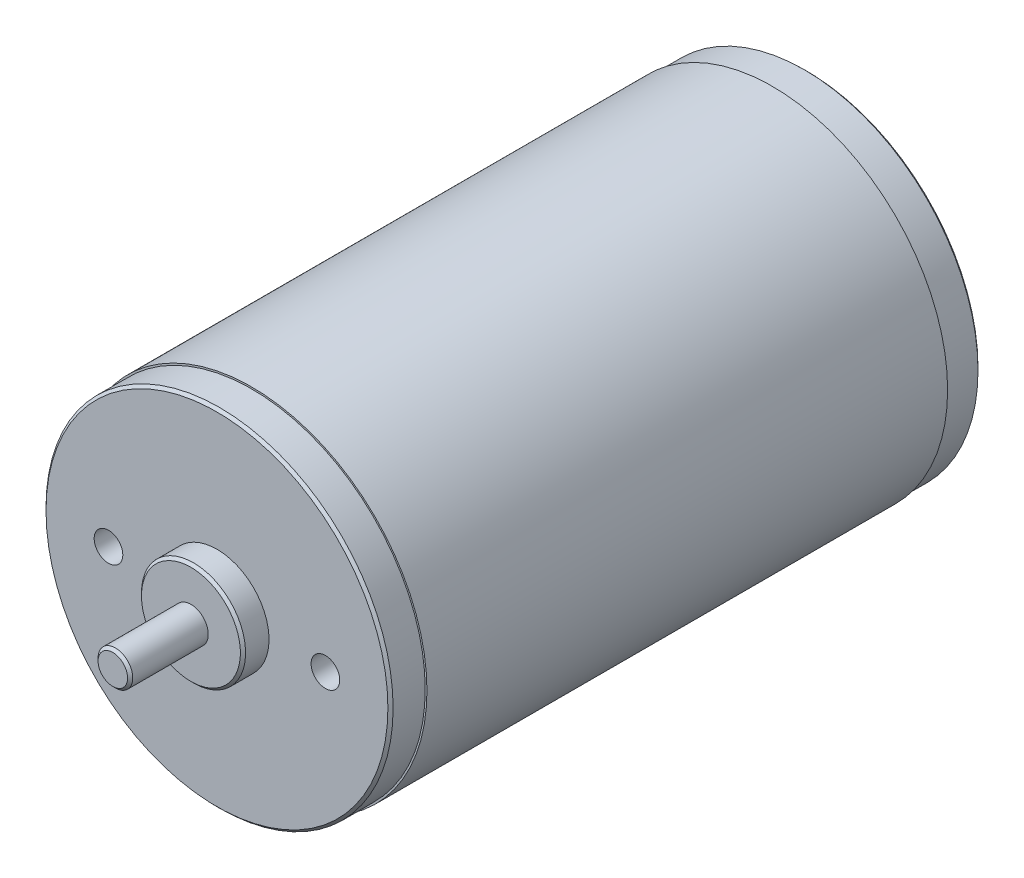
ISO-10303-21;
HEADER;
FILE_DESCRIPTION(('STEP AP214'),'2;1');
FILE_NAME('part.step','',(''),(''),'','','');
FILE_SCHEMA(('AUTOMOTIVE_DESIGN { 1 0 10303 214 1 1 1 1 }'));
ENDSEC;
DATA;
#1=APPLICATION_CONTEXT('core data for automotive mechanical design processes');
#2=APPLICATION_PROTOCOL_DEFINITION('international standard','automotive_design',2000,#1);
#3=PRODUCT_CONTEXT('',#1,'mechanical');
#4=PRODUCT('Part','Part','',(#3));
#5=PRODUCT_RELATED_PRODUCT_CATEGORY('part','',(#4));
#6=PRODUCT_DEFINITION_FORMATION('','',#4);
#7=PRODUCT_DEFINITION_CONTEXT('part definition',#1,'design');
#8=PRODUCT_DEFINITION('design','',#6,#7);
#9=PRODUCT_DEFINITION_SHAPE('','',#8);
#10=(LENGTH_UNIT() NAMED_UNIT(*) SI_UNIT(.MILLI.,.METRE.));
#11=(NAMED_UNIT(*) PLANE_ANGLE_UNIT() SI_UNIT($,.RADIAN.));
#12=(NAMED_UNIT(*) SI_UNIT($,.STERADIAN.) SOLID_ANGLE_UNIT());
#13=UNCERTAINTY_MEASURE_WITH_UNIT(LENGTH_MEASURE(1.E-05),#10,'distance_accuracy_value','');
#14=(GEOMETRIC_REPRESENTATION_CONTEXT(3) GLOBAL_UNCERTAINTY_ASSIGNED_CONTEXT((#13)) GLOBAL_UNIT_ASSIGNED_CONTEXT((#10,
#11,#12)) REPRESENTATION_CONTEXT('',''));
#15=CARTESIAN_POINT('',(0.,0.,0.));
#16=DIRECTION('',(0.,0.,1.));
#17=DIRECTION('',(1.,0.,0.));
#18=AXIS2_PLACEMENT_3D('',#15,#16,#17);
#19=CARTESIAN_POINT('',(0.,0.,12.));
#20=DIRECTION('',(0.,0.,1.));
#21=DIRECTION('',(1.,0.,0.));
#22=AXIS2_PLACEMENT_3D('',#19,#20,#21);
#23=PLANE('',#22);
#24=CARTESIAN_POINT('',(0.,0.,12.0000000000573));
#25=DIRECTION('',(0.,0.,-1.));
#26=DIRECTION('',(-1.,0.,0.));
#27=AXIS2_PLACEMENT_3D('',#24,#25,#26);
#28=CIRCLE('',#27,1.70000000002801);
#29=CARTESIAN_POINT('',(-1.70000000002801,0.,12.0000000000573));
#30=VERTEX_POINT('',#29);
#31=EDGE_CURVE('E19',#30,#30,#28,.T.);
#32=ORIENTED_EDGE('',*,*,#31,.F.);
#33=EDGE_LOOP('',(#32));
#34=FACE_BOUND('',#33,.T.);
#35=ADVANCED_FACE('F16',(#34),#23,.T.);
#36=CARTESIAN_POINT('',(0.,0.,11.7000000000758));
#37=DIRECTION('',(0.,0.,-1.));
#38=DIRECTION('',(-1.,0.,0.));
#39=AXIS2_PLACEMENT_3D('',#36,#37,#38);
#40=CONICAL_SURFACE('',#39,2.00000000000955,0.785398163397448);
#41=CARTESIAN_POINT('',(0.,0.,11.7));
#42=DIRECTION('',(0.,0.,-1.));
#43=DIRECTION('',(-1.,0.,0.));
#44=AXIS2_PLACEMENT_3D('',#41,#42,#43);
#45=CIRCLE('',#44,2.);
#46=CARTESIAN_POINT('',(-2.,0.,11.7));
#47=VERTEX_POINT('',#46);
#48=EDGE_CURVE('E52',#47,#47,#45,.T.);
#49=ORIENTED_EDGE('',*,*,#48,.F.);
#50=EDGE_LOOP('',(#49));
#51=FACE_BOUND('',#50,.T.);
#52=ORIENTED_EDGE('',*,*,#31,.T.);
#53=EDGE_LOOP('',(#52));
#54=FACE_BOUND('',#53,.T.);
#55=ADVANCED_FACE('F104',(#51,#54),#40,.T.);
#56=CARTESIAN_POINT('',(0.,0.,12.));
#57=DIRECTION('',(0.,0.,-1.));
#58=DIRECTION('',(-1.,0.,0.));
#59=AXIS2_PLACEMENT_3D('',#56,#57,#58);
#60=CYLINDRICAL_SURFACE('',#59,2.);
#61=CARTESIAN_POINT('',(0.,0.,3.));
#62=DIRECTION('',(0.,0.,-1.));
#63=DIRECTION('',(-1.,0.,0.));
#64=AXIS2_PLACEMENT_3D('',#61,#62,#63);
#65=CIRCLE('',#64,2.);
#66=CARTESIAN_POINT('',(-2.,0.,3.));
#67=VERTEX_POINT('',#66);
#68=EDGE_CURVE('E55',#67,#67,#65,.T.);
#69=ORIENTED_EDGE('',*,*,#68,.F.);
#70=EDGE_LOOP('',(#69));
#71=FACE_BOUND('',#70,.T.);
#72=ORIENTED_EDGE('',*,*,#48,.T.);
#73=EDGE_LOOP('',(#72));
#74=FACE_BOUND('',#73,.T.);
#75=ADVANCED_FACE('F100',(#71,#74),#60,.T.);
#76=CARTESIAN_POINT('',(0.,0.,-69.5));
#77=DIRECTION('',(0.,0.,-1.));
#78=DIRECTION('',(-1.,0.,0.));
#79=AXIS2_PLACEMENT_3D('',#76,#77,#78);
#80=PLANE('',#79);
#81=CARTESIAN_POINT('',(0.,0.,-69.5000000000618));
#82=DIRECTION('',(0.,0.,1.));
#83=DIRECTION('',(1.,0.,0.));
#84=AXIS2_PLACEMENT_3D('',#81,#82,#83);
#85=CIRCLE('',#84,6.02500000002237);
#86=CARTESIAN_POINT('',(6.02500000002237,0.,-69.5000000000618));
#87=VERTEX_POINT('',#86);
#88=EDGE_CURVE('E90',#87,#87,#85,.T.);
#89=ORIENTED_EDGE('',*,*,#88,.F.);
#90=EDGE_LOOP('',(#89));
#91=FACE_BOUND('',#90,.T.);
#92=ADVANCED_FACE('F103',(#91),#80,.T.);
#93=CARTESIAN_POINT('',(0.,0.,3.));
#94=DIRECTION('',(0.,0.,1.));
#95=DIRECTION('',(1.,0.,0.));
#96=AXIS2_PLACEMENT_3D('',#93,#94,#95);
#97=PLANE('',#96);
#98=ORIENTED_EDGE('',*,*,#68,.T.);
#99=EDGE_LOOP('',(#98));
#100=FACE_BOUND('',#99,.T.);
#101=CARTESIAN_POINT('',(0.,0.,2.9999999999859));
#102=DIRECTION('',(0.,0.,-1.));
#103=DIRECTION('',(-1.,0.,0.));
#104=AXIS2_PLACEMENT_3D('',#101,#102,#103);
#105=CIRCLE('',#104,5.70000000004711);
#106=CARTESIAN_POINT('',(-5.70000000004711,0.,2.9999999999859));
#107=VERTEX_POINT('',#106);
#108=EDGE_CURVE('E48',#107,#107,#105,.T.);
#109=ORIENTED_EDGE('',*,*,#108,.F.);
#110=EDGE_LOOP('',(#109));
#111=FACE_BOUND('',#110,.T.);
#112=ADVANCED_FACE('F97',(#100,#111),#97,.T.);
#113=CARTESIAN_POINT('',(0.,0.,-69.2000000000803));
#114=DIRECTION('',(0.,0.,1.));
#115=DIRECTION('',(1.,0.,0.));
#116=AXIS2_PLACEMENT_3D('',#113,#114,#115);
#117=CONICAL_SURFACE('',#116,6.32500000000391,0.785398163397448);
#118=ORIENTED_EDGE('',*,*,#88,.T.);
#119=EDGE_LOOP('',(#118));
#120=FACE_BOUND('',#119,.T.);
#121=CARTESIAN_POINT('',(0.,0.,-69.2));
#122=DIRECTION('',(0.,0.,1.));
#123=DIRECTION('',(1.,0.,0.));
#124=AXIS2_PLACEMENT_3D('',#121,#122,#123);
#125=CIRCLE('',#124,6.325);
#126=CARTESIAN_POINT('',(6.325,0.,-69.2));
#127=VERTEX_POINT('',#126);
#128=EDGE_CURVE('E42',#127,#127,#125,.T.);
#129=ORIENTED_EDGE('',*,*,#128,.F.);
#130=EDGE_LOOP('',(#129));
#131=FACE_BOUND('',#130,.T.);
#132=ADVANCED_FACE('F35',(#120,#131),#117,.T.);
#133=CARTESIAN_POINT('',(-12.5,0.,-8.10000000012678));
#134=DIRECTION('',(0.,0.,1.));
#135=DIRECTION('',(1.,0.,0.));
#136=AXIS2_PLACEMENT_3D('',#133,#134,#135);
#137=CONICAL_SURFACE('',#136,1.6499999998814,1.02974425849465);
#138=CARTESIAN_POINT('',(-12.5000000002728,0.,-9.09142002154795));
#139=VERTEX_POINT('',#138);
#140=VERTEX_LOOP('',#139);
#141=FACE_BOUND('',#140,.T.);
#142=CARTESIAN_POINT('',(-12.5,0.,-8.1));
#143=DIRECTION('',(0.,0.,1.));
#144=DIRECTION('',(1.,0.,0.));
#145=AXIS2_PLACEMENT_3D('',#142,#143,#144);
#146=CIRCLE('',#145,1.65);
#147=CARTESIAN_POINT('',(-10.85,0.,-8.1));
#148=VERTEX_POINT('',#147);
#149=EDGE_CURVE('E39',#148,#148,#146,.T.);
#150=ORIENTED_EDGE('',*,*,#149,.T.);
#151=EDGE_LOOP('',(#150));
#152=FACE_BOUND('',#151,.T.);
#153=ADVANCED_FACE('F31',(#141,#152),#137,.F.);
#154=CARTESIAN_POINT('',(12.5,0.,-8.10000000012678));
#155=DIRECTION('',(0.,0.,1.));
#156=DIRECTION('',(1.,0.,0.));
#157=AXIS2_PLACEMENT_3D('',#154,#155,#156);
#158=CONICAL_SURFACE('',#157,1.64999999985866,1.02974425848248);
#159=CARTESIAN_POINT('',(12.4999999997328,0.,-9.09142002157637));
#160=VERTEX_POINT('',#159);
#161=VERTEX_LOOP('',#160);
#162=FACE_BOUND('',#161,.T.);
#163=CARTESIAN_POINT('',(12.5,0.,-8.1));
#164=DIRECTION('',(0.,0.,1.));
#165=DIRECTION('',(1.,0.,0.));
#166=AXIS2_PLACEMENT_3D('',#163,#164,#165);
#167=CIRCLE('',#166,1.65);
#168=CARTESIAN_POINT('',(14.15,0.,-8.1));
#169=VERTEX_POINT('',#168);
#170=EDGE_CURVE('E41',#169,#169,#167,.T.);
#171=ORIENTED_EDGE('',*,*,#170,.T.);
#172=EDGE_LOOP('',(#171));
#173=FACE_BOUND('',#172,.T.);
#174=ADVANCED_FACE('F34',(#162,#173),#158,.F.);
#175=CARTESIAN_POINT('',(0.,0.,2.70000000000437));
#176=DIRECTION('',(0.,0.,-1.));
#177=DIRECTION('',(-1.,0.,0.));
#178=AXIS2_PLACEMENT_3D('',#175,#176,#177);
#179=CONICAL_SURFACE('',#178,6.00000000002865,0.785398163397448);
#180=CARTESIAN_POINT('',(0.,0.,2.70000000000002));
#181=DIRECTION('',(0.,0.,-1.));
#182=DIRECTION('',(-1.,0.,0.));
#183=AXIS2_PLACEMENT_3D('',#180,#181,#182);
#184=CIRCLE('',#183,6.);
#185=CARTESIAN_POINT('',(-6.,0.,2.70000000000002));
#186=VERTEX_POINT('',#185);
#187=EDGE_CURVE('E45',#186,#186,#184,.T.);
#188=ORIENTED_EDGE('',*,*,#187,.F.);
#189=EDGE_LOOP('',(#188));
#190=FACE_BOUND('',#189,.T.);
#191=ORIENTED_EDGE('',*,*,#108,.T.);
#192=EDGE_LOOP('',(#191));
#193=FACE_BOUND('',#192,.T.);
#194=ADVANCED_FACE('F177',(#190,#193),#179,.T.);
#195=CARTESIAN_POINT('',(0.,0.,-69.5));
#196=DIRECTION('',(0.,0.,1.));
#197=DIRECTION('',(1.,0.,0.));
#198=AXIS2_PLACEMENT_3D('',#195,#196,#197);
#199=CYLINDRICAL_SURFACE('',#198,6.325);
#200=ORIENTED_EDGE('',*,*,#128,.T.);
#201=EDGE_LOOP('',(#200));
#202=FACE_BOUND('',#201,.T.);
#203=CARTESIAN_POINT('',(0.,0.,-68.));
#204=DIRECTION('',(0.,0.,1.));
#205=DIRECTION('',(1.,0.,0.));
#206=AXIS2_PLACEMENT_3D('',#203,#204,#205);
#207=CIRCLE('',#206,6.325);
#208=CARTESIAN_POINT('',(6.325,0.,-68.));
#209=VERTEX_POINT('',#208);
#210=EDGE_CURVE('E84',#209,#209,#207,.F.);
#211=ORIENTED_EDGE('',*,*,#210,.T.);
#212=EDGE_LOOP('',(#211));
#213=FACE_BOUND('',#212,.T.);
#214=ADVANCED_FACE('F173',(#202,#213),#199,.T.);
#215=CARTESIAN_POINT('',(-12.5,0.,0.));
#216=DIRECTION('',(0.,0.,1.));
#217=DIRECTION('',(1.,0.,0.));
#218=AXIS2_PLACEMENT_3D('',#215,#216,#217);
#219=CYLINDRICAL_SURFACE('',#218,1.65);
#220=CARTESIAN_POINT('',(-12.5,0.,0.));
#221=DIRECTION('',(0.,0.,1.));
#222=DIRECTION('',(1.,0.,0.));
#223=AXIS2_PLACEMENT_3D('',#220,#221,#222);
#224=CIRCLE('',#223,1.65);
#225=CARTESIAN_POINT('',(-10.85,0.,0.));
#226=VERTEX_POINT('',#225);
#227=EDGE_CURVE('E81',#226,#226,#224,.F.);
#228=ORIENTED_EDGE('',*,*,#227,.F.);
#229=EDGE_LOOP('',(#228));
#230=FACE_BOUND('',#229,.T.);
#231=ORIENTED_EDGE('',*,*,#149,.F.);
#232=EDGE_LOOP('',(#231));
#233=FACE_BOUND('',#232,.T.);
#234=ADVANCED_FACE('F169',(#230,#233),#219,.F.);
#235=CARTESIAN_POINT('',(12.5,0.,0.));
#236=DIRECTION('',(0.,0.,1.));
#237=DIRECTION('',(1.,0.,0.));
#238=AXIS2_PLACEMENT_3D('',#235,#236,#237);
#239=CYLINDRICAL_SURFACE('',#238,1.65);
#240=CARTESIAN_POINT('',(12.5,0.,0.));
#241=DIRECTION('',(0.,0.,1.));
#242=DIRECTION('',(1.,0.,0.));
#243=AXIS2_PLACEMENT_3D('',#240,#241,#242);
#244=CIRCLE('',#243,1.65);
#245=CARTESIAN_POINT('',(14.15,0.,0.));
#246=VERTEX_POINT('',#245);
#247=EDGE_CURVE('E77',#246,#246,#244,.F.);
#248=ORIENTED_EDGE('',*,*,#247,.F.);
#249=EDGE_LOOP('',(#248));
#250=FACE_BOUND('',#249,.T.);
#251=ORIENTED_EDGE('',*,*,#170,.F.);
#252=EDGE_LOOP('',(#251));
#253=FACE_BOUND('',#252,.T.);
#254=ADVANCED_FACE('F165',(#250,#253),#239,.F.);
#255=CARTESIAN_POINT('',(0.,0.,3.));
#256=DIRECTION('',(0.,0.,-1.));
#257=DIRECTION('',(-1.,0.,0.));
#258=AXIS2_PLACEMENT_3D('',#255,#256,#257);
#259=CYLINDRICAL_SURFACE('',#258,6.);
#260=CARTESIAN_POINT('',(0.,0.,0.));
#261=DIRECTION('',(0.,0.,-1.));
#262=DIRECTION('',(-1.,0.,0.));
#263=AXIS2_PLACEMENT_3D('',#260,#261,#262);
#264=CIRCLE('',#263,6.);
#265=CARTESIAN_POINT('',(-6.,0.,0.));
#266=VERTEX_POINT('',#265);
#267=EDGE_CURVE('E73',#266,#266,#264,.T.);
#268=ORIENTED_EDGE('',*,*,#267,.F.);
#269=EDGE_LOOP('',(#268));
#270=FACE_BOUND('',#269,.T.);
#271=ORIENTED_EDGE('',*,*,#187,.T.);
#272=EDGE_LOOP('',(#271));
#273=FACE_BOUND('',#272,.T.);
#274=ADVANCED_FACE('F162',(#270,#273),#259,.T.);
#275=CARTESIAN_POINT('',(0.,0.,-68.));
#276=DIRECTION('',(0.,0.,1.));
#277=DIRECTION('',(1.,0.,0.));
#278=AXIS2_PLACEMENT_3D('',#275,#276,#277);
#279=PLANE('',#278);
#280=ORIENTED_EDGE('',*,*,#210,.F.);
#281=EDGE_LOOP('',(#280));
#282=FACE_BOUND('',#281,.T.);
#283=CARTESIAN_POINT('',(0.,0.,-68.));
#284=DIRECTION('',(0.,0.,1.));
#285=DIRECTION('',(1.,0.,0.));
#286=AXIS2_PLACEMENT_3D('',#283,#284,#285);
#287=CIRCLE('',#286,19.7);
#288=CARTESIAN_POINT('',(19.7,0.,-68.));
#289=VERTEX_POINT('',#288);
#290=EDGE_CURVE('E70',#289,#289,#287,.T.);
#291=ORIENTED_EDGE('',*,*,#290,.F.);
#292=EDGE_LOOP('',(#291));
#293=FACE_BOUND('',#292,.T.);
#294=ADVANCED_FACE('F158',(#282,#293),#279,.F.);
#295=CARTESIAN_POINT('',(0.,0.,0.));
#296=DIRECTION('',(0.,0.,1.));
#297=DIRECTION('',(1.,0.,0.));
#298=AXIS2_PLACEMENT_3D('',#295,#296,#297);
#299=PLANE('',#298);
#300=ORIENTED_EDGE('',*,*,#267,.T.);
#301=EDGE_LOOP('',(#300));
#302=FACE_BOUND('',#301,.T.);
#303=ORIENTED_EDGE('',*,*,#247,.T.);
#304=EDGE_LOOP('',(#303));
#305=FACE_BOUND('',#304,.T.);
#306=ORIENTED_EDGE('',*,*,#227,.T.);
#307=EDGE_LOOP('',(#306));
#308=FACE_BOUND('',#307,.T.);
#309=CARTESIAN_POINT('',(0.,0.,0.));
#310=DIRECTION('',(0.,0.,-1.));
#311=DIRECTION('',(-1.,0.,0.));
#312=AXIS2_PLACEMENT_3D('',#309,#310,#311);
#313=CIRCLE('',#312,19.7);
#314=CARTESIAN_POINT('',(-19.7,0.,0.));
#315=VERTEX_POINT('',#314);
#316=EDGE_CURVE('E66',#315,#315,#313,.T.);
#317=ORIENTED_EDGE('',*,*,#316,.F.);
#318=EDGE_LOOP('',(#317));
#319=FACE_BOUND('',#318,.T.);
#320=ADVANCED_FACE('F154',(#302,#305,#308,#319),#299,.T.);
#321=CARTESIAN_POINT('',(0.,0.,-67.7));
#322=DIRECTION('',(0.,0.,1.));
#323=DIRECTION('',(1.,0.,0.));
#324=AXIS2_PLACEMENT_3D('',#321,#322,#323);
#325=CONICAL_SURFACE('',#324,20.,0.785398163397466);
#326=ORIENTED_EDGE('',*,*,#290,.T.);
#327=EDGE_LOOP('',(#326));
#328=FACE_BOUND('',#327,.T.);
#329=CARTESIAN_POINT('',(0.,0.,-67.7));
#330=DIRECTION('',(0.,0.,-1.));
#331=DIRECTION('',(-1.,0.,0.));
#332=AXIS2_PLACEMENT_3D('',#329,#330,#331);
#333=CIRCLE('',#332,20.);
#334=CARTESIAN_POINT('',(-20.,0.,-67.7));
#335=VERTEX_POINT('',#334);
#336=EDGE_CURVE('E69',#335,#335,#333,.F.);
#337=ORIENTED_EDGE('',*,*,#336,.F.);
#338=EDGE_LOOP('',(#337));
#339=FACE_BOUND('',#338,.T.);
#340=ADVANCED_FACE('F150',(#328,#339),#325,.T.);
#341=CARTESIAN_POINT('',(0.,0.,-0.299999999999963));
#342=DIRECTION('',(0.,0.,-1.));
#343=DIRECTION('',(-1.,0.,0.));
#344=AXIS2_PLACEMENT_3D('',#341,#342,#343);
#345=CONICAL_SURFACE('',#344,20.,0.785398163397472);
#346=ORIENTED_EDGE('',*,*,#316,.T.);
#347=EDGE_LOOP('',(#346));
#348=FACE_BOUND('',#347,.T.);
#349=CARTESIAN_POINT('',(0.,0.,-0.299999999999964));
#350=DIRECTION('',(0.,0.,1.));
#351=DIRECTION('',(1.,0.,0.));
#352=AXIS2_PLACEMENT_3D('',#349,#350,#351);
#353=CIRCLE('',#352,20.);
#354=CARTESIAN_POINT('',(20.,0.,-0.299999999999964));
#355=VERTEX_POINT('',#354);
#356=EDGE_CURVE('E65',#355,#355,#353,.F.);
#357=ORIENTED_EDGE('',*,*,#356,.F.);
#358=EDGE_LOOP('',(#357));
#359=FACE_BOUND('',#358,.T.);
#360=ADVANCED_FACE('F146',(#348,#359),#345,.T.);
#361=CARTESIAN_POINT('',(0.,0.,-64.));
#362=DIRECTION('',(0.,0.,-1.));
#363=DIRECTION('',(-1.,0.,0.));
#364=AXIS2_PLACEMENT_3D('',#361,#362,#363);
#365=CYLINDRICAL_SURFACE('',#364,20.);
#366=CARTESIAN_POINT('',(0.,0.,-64.));
#367=DIRECTION('',(0.,0.,-1.));
#368=DIRECTION('',(-1.,0.,0.));
#369=AXIS2_PLACEMENT_3D('',#366,#367,#368);
#370=CIRCLE('',#369,20.);
#371=CARTESIAN_POINT('',(-20.,0.,-64.));
#372=VERTEX_POINT('',#371);
#373=EDGE_CURVE('E62',#372,#372,#370,.F.);
#374=ORIENTED_EDGE('',*,*,#373,.F.);
#375=EDGE_LOOP('',(#374));
#376=FACE_BOUND('',#375,.T.);
#377=ORIENTED_EDGE('',*,*,#336,.T.);
#378=EDGE_LOOP('',(#377));
#379=FACE_BOUND('',#378,.T.);
#380=ADVANCED_FACE('F142',(#376,#379),#365,.T.);
#381=CARTESIAN_POINT('',(0.,0.,-4.));
#382=DIRECTION('',(0.,0.,1.));
#383=DIRECTION('',(1.,0.,0.));
#384=AXIS2_PLACEMENT_3D('',#381,#382,#383);
#385=CYLINDRICAL_SURFACE('',#384,20.);
#386=CARTESIAN_POINT('',(0.,0.,-4.));
#387=DIRECTION('',(0.,0.,1.));
#388=DIRECTION('',(1.,0.,0.));
#389=AXIS2_PLACEMENT_3D('',#386,#387,#388);
#390=CIRCLE('',#389,20.);
#391=CARTESIAN_POINT('',(20.,0.,-4.));
#392=VERTEX_POINT('',#391);
#393=EDGE_CURVE('E59',#392,#392,#390,.F.);
#394=ORIENTED_EDGE('',*,*,#393,.F.);
#395=EDGE_LOOP('',(#394));
#396=FACE_BOUND('',#395,.T.);
#397=ORIENTED_EDGE('',*,*,#356,.T.);
#398=EDGE_LOOP('',(#397));
#399=FACE_BOUND('',#398,.T.);
#400=ADVANCED_FACE('F138',(#396,#399),#385,.T.);
#401=CARTESIAN_POINT('',(0.,0.,-64.));
#402=DIRECTION('',(0.,0.,-1.));
#403=DIRECTION('',(-1.,0.,0.));
#404=AXIS2_PLACEMENT_3D('',#401,#402,#403);
#405=PLANE('',#404);
#406=CARTESIAN_POINT('',(0.,0.,-64.));
#407=DIRECTION('',(0.,0.,1.));
#408=DIRECTION('',(1.,0.,0.));
#409=AXIS2_PLACEMENT_3D('',#406,#407,#408);
#410=CIRCLE('',#409,20.2);
#411=CARTESIAN_POINT('',(20.2,0.,-64.));
#412=VERTEX_POINT('',#411);
#413=EDGE_CURVE('E25',#412,#412,#410,.T.);
#414=ORIENTED_EDGE('',*,*,#413,.F.);
#415=EDGE_LOOP('',(#414));
#416=FACE_BOUND('',#415,.T.);
#417=ORIENTED_EDGE('',*,*,#373,.T.);
#418=EDGE_LOOP('',(#417));
#419=FACE_BOUND('',#418,.T.);
#420=ADVANCED_FACE('F131',(#416,#419),#405,.T.);
#421=CARTESIAN_POINT('',(0.,0.,-4.));
#422=DIRECTION('',(0.,0.,1.));
#423=DIRECTION('',(1.,0.,0.));
#424=AXIS2_PLACEMENT_3D('',#421,#422,#423);
#425=PLANE('',#424);
#426=CARTESIAN_POINT('',(0.,0.,-4.));
#427=DIRECTION('',(0.,0.,1.));
#428=DIRECTION('',(1.,0.,0.));
#429=AXIS2_PLACEMENT_3D('',#426,#427,#428);
#430=CIRCLE('',#429,20.2);
#431=CARTESIAN_POINT('',(20.2,0.,-4.));
#432=VERTEX_POINT('',#431);
#433=EDGE_CURVE('E11',#432,#432,#430,.F.);
#434=ORIENTED_EDGE('',*,*,#433,.F.);
#435=EDGE_LOOP('',(#434));
#436=FACE_BOUND('',#435,.T.);
#437=ORIENTED_EDGE('',*,*,#393,.T.);
#438=EDGE_LOOP('',(#437));
#439=FACE_BOUND('',#438,.T.);
#440=ADVANCED_FACE('F123',(#436,#439),#425,.T.);
#441=CARTESIAN_POINT('',(0.,0.,-68.));
#442=DIRECTION('',(0.,0.,1.));
#443=DIRECTION('',(1.,0.,0.));
#444=AXIS2_PLACEMENT_3D('',#441,#442,#443);
#445=CYLINDRICAL_SURFACE('',#444,20.2);
#446=ORIENTED_EDGE('',*,*,#433,.T.);
#447=EDGE_LOOP('',(#446));
#448=FACE_BOUND('',#447,.T.);
#449=ORIENTED_EDGE('',*,*,#413,.T.);
#450=EDGE_LOOP('',(#449));
#451=FACE_BOUND('',#450,.T.);
#452=ADVANCED_FACE('F121',(#448,#451),#445,.T.);
#453=CLOSED_SHELL('',(#35,#55,#75,#92,#112,#132,#153,#174,#194,#214,#234,#254,#274,#294,#320,
#340,#360,#380,#400,#420,#440,#452));
#454=MANIFOLD_SOLID_BREP('B1',#453);
#455=ADVANCED_BREP_SHAPE_REPRESENTATION('',(#18,#454),#14);
#456=SHAPE_DEFINITION_REPRESENTATION(#9,#455);
ENDSEC;
END-ISO-10303-21;
